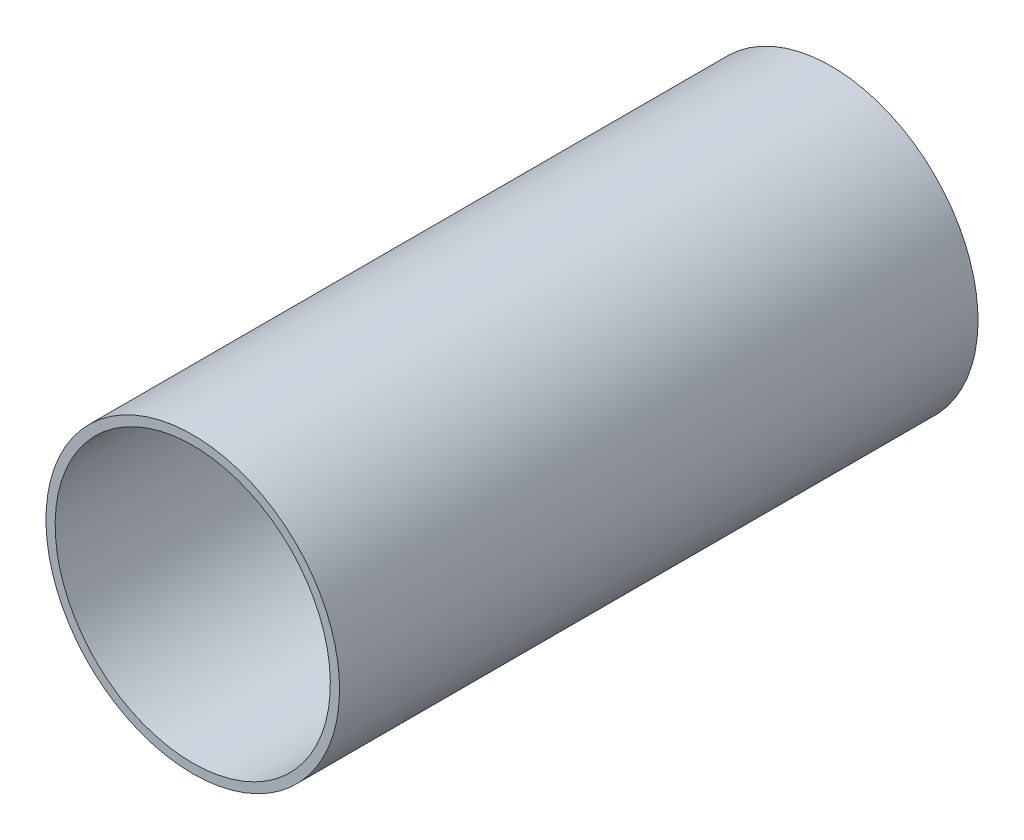
ISO-10303-21;
HEADER;
FILE_DESCRIPTION(('STEP AP214'),'2;1');
FILE_NAME('part.step','',(''),(''),'','','');
FILE_SCHEMA(('AUTOMOTIVE_DESIGN { 1 0 10303 214 1 1 1 1 }'));
ENDSEC;
DATA;
#1=APPLICATION_CONTEXT('core data for automotive mechanical design processes');
#2=APPLICATION_PROTOCOL_DEFINITION('international standard','automotive_design',2000,#1);
#3=PRODUCT_CONTEXT('',#1,'mechanical');
#4=PRODUCT('Part','Part','',(#3));
#5=PRODUCT_RELATED_PRODUCT_CATEGORY('part','',(#4));
#6=PRODUCT_DEFINITION_FORMATION('','',#4);
#7=PRODUCT_DEFINITION_CONTEXT('part definition',#1,'design');
#8=PRODUCT_DEFINITION('design','',#6,#7);
#9=PRODUCT_DEFINITION_SHAPE('','',#8);
#10=(LENGTH_UNIT() NAMED_UNIT(*) SI_UNIT(.MILLI.,.METRE.));
#11=(NAMED_UNIT(*) PLANE_ANGLE_UNIT() SI_UNIT($,.RADIAN.));
#12=(NAMED_UNIT(*) SI_UNIT($,.STERADIAN.) SOLID_ANGLE_UNIT());
#13=UNCERTAINTY_MEASURE_WITH_UNIT(LENGTH_MEASURE(1.E-05),#10,'distance_accuracy_value','');
#14=(GEOMETRIC_REPRESENTATION_CONTEXT(3) GLOBAL_UNCERTAINTY_ASSIGNED_CONTEXT((#13)) GLOBAL_UNIT_ASSIGNED_CONTEXT((#10,
#11,#12)) REPRESENTATION_CONTEXT('',''));
#15=CARTESIAN_POINT('',(0.,0.,0.));
#16=DIRECTION('',(0.,0.,1.));
#17=DIRECTION('',(1.,0.,0.));
#18=AXIS2_PLACEMENT_3D('',#15,#16,#17);
#19=CARTESIAN_POINT('',(166.497,-143.637,-0.045));
#20=DIRECTION('',(0.,0.,-1.));
#21=DIRECTION('',(0.,-1.,0.));
#22=AXIS2_PLACEMENT_3D('',#19,#20,#21);
#23=CYLINDRICAL_SURFACE('',#22,0.375);
#24=CARTESIAN_POINT('',(166.497,-143.637,-0.035));
#25=DIRECTION('',(0.,0.,-1.));
#26=DIRECTION('',(0.,-1.,0.));
#27=AXIS2_PLACEMENT_3D('',#24,#25,#26);
#28=CIRCLE('',#27,0.375);
#29=CARTESIAN_POINT('',(166.497,-144.012,-0.035));
#30=VERTEX_POINT('',#29);
#31=EDGE_CURVE('E64',#30,#30,#28,.T.);
#32=ORIENTED_EDGE('',*,*,#31,.T.);
#33=DIRECTION('',(0.,0.,1.));
#34=VECTOR('',#33,1.);
#35=CARTESIAN_POINT('',(166.497,-144.012,-0.045));
#36=LINE('',#35,#34);
#37=CARTESIAN_POINT('',(166.497,-144.012,1.705));
#38=VERTEX_POINT('',#37);
#39=EDGE_CURVE('E11',#30,#38,#36,.T.);
#40=ORIENTED_EDGE('',*,*,#39,.T.);
#41=CARTESIAN_POINT('',(166.497,-143.637,1.705));
#42=DIRECTION('',(0.,0.,-1.));
#43=DIRECTION('',(0.,-1.,0.));
#44=AXIS2_PLACEMENT_3D('',#41,#42,#43);
#45=CIRCLE('',#44,0.375);
#46=EDGE_CURVE('E25',#38,#38,#45,.T.);
#47=ORIENTED_EDGE('',*,*,#46,.F.);
#48=ORIENTED_EDGE('',*,*,#39,.F.);
#49=EDGE_LOOP('',(#32,#40,#47,#48));
#50=FACE_BOUND('',#49,.T.);
#51=ADVANCED_FACE('F17',(#50),#23,.F.);
#52=CARTESIAN_POINT('',(166.497,-144.037,1.705));
#53=DIRECTION('',(0.,0.,1.));
#54=DIRECTION('',(1.,0.,0.));
#55=AXIS2_PLACEMENT_3D('',#52,#53,#54);
#56=PLANE('',#55);
#57=ORIENTED_EDGE('',*,*,#46,.T.);
#58=EDGE_LOOP('',(#57));
#59=FACE_BOUND('',#58,.T.);
#60=CARTESIAN_POINT('',(166.497,-143.637,1.705));
#61=DIRECTION('',(0.,0.,1.));
#62=DIRECTION('',(0.,-1.,0.));
#63=AXIS2_PLACEMENT_3D('',#60,#61,#62);
#64=CIRCLE('',#63,0.4);
#65=CARTESIAN_POINT('',(166.497,-144.037,1.705));
#66=VERTEX_POINT('',#65);
#67=EDGE_CURVE('E56',#66,#66,#64,.T.);
#68=ORIENTED_EDGE('',*,*,#67,.T.);
#69=EDGE_LOOP('',(#68));
#70=FACE_BOUND('',#69,.T.);
#71=ADVANCED_FACE('F76',(#59,#70),#56,.T.);
#72=CARTESIAN_POINT('',(166.497,-144.037,-0.035));
#73=DIRECTION('',(0.,0.,1.));
#74=DIRECTION('',(1.,0.,0.));
#75=AXIS2_PLACEMENT_3D('',#72,#73,#74);
#76=PLANE('',#75);
#77=ORIENTED_EDGE('',*,*,#31,.F.);
#78=EDGE_LOOP('',(#77));
#79=FACE_BOUND('',#78,.T.);
#80=CARTESIAN_POINT('',(166.497,-143.637,-0.035));
#81=DIRECTION('',(0.,0.,1.));
#82=DIRECTION('',(0.,-1.,0.));
#83=AXIS2_PLACEMENT_3D('',#80,#81,#82);
#84=CIRCLE('',#83,0.4);
#85=CARTESIAN_POINT('',(166.497,-144.037,-0.035));
#86=VERTEX_POINT('',#85);
#87=EDGE_CURVE('E55',#86,#86,#84,.T.);
#88=ORIENTED_EDGE('',*,*,#87,.F.);
#89=EDGE_LOOP('',(#88));
#90=FACE_BOUND('',#89,.T.);
#91=ADVANCED_FACE('F84',(#79,#90),#76,.F.);
#92=CARTESIAN_POINT('',(166.497,-143.637,-0.035));
#93=DIRECTION('',(0.,0.,-1.));
#94=DIRECTION('',(0.,-1.,0.));
#95=AXIS2_PLACEMENT_3D('',#92,#93,#94);
#96=CYLINDRICAL_SURFACE('',#95,0.4);
#97=ORIENTED_EDGE('',*,*,#87,.T.);
#98=DIRECTION('',(0.,0.,1.));
#99=VECTOR('',#98,1.);
#100=CARTESIAN_POINT('',(166.497,-144.037,-0.035));
#101=LINE('',#100,#99);
#102=EDGE_CURVE('E52',#86,#66,#101,.T.);
#103=ORIENTED_EDGE('',*,*,#102,.T.);
#104=ORIENTED_EDGE('',*,*,#67,.F.);
#105=ORIENTED_EDGE('',*,*,#102,.F.);
#106=EDGE_LOOP('',(#97,#103,#104,#105));
#107=FACE_BOUND('',#106,.T.);
#108=ADVANCED_FACE('F53',(#107),#96,.T.);
#109=CLOSED_SHELL('',(#51,#71,#91,#108));
#110=MANIFOLD_SOLID_BREP('B1',#109);
#111=ADVANCED_BREP_SHAPE_REPRESENTATION('',(#18,#110),#14);
#112=SHAPE_DEFINITION_REPRESENTATION(#9,#111);
ENDSEC;
END-ISO-10303-21;
